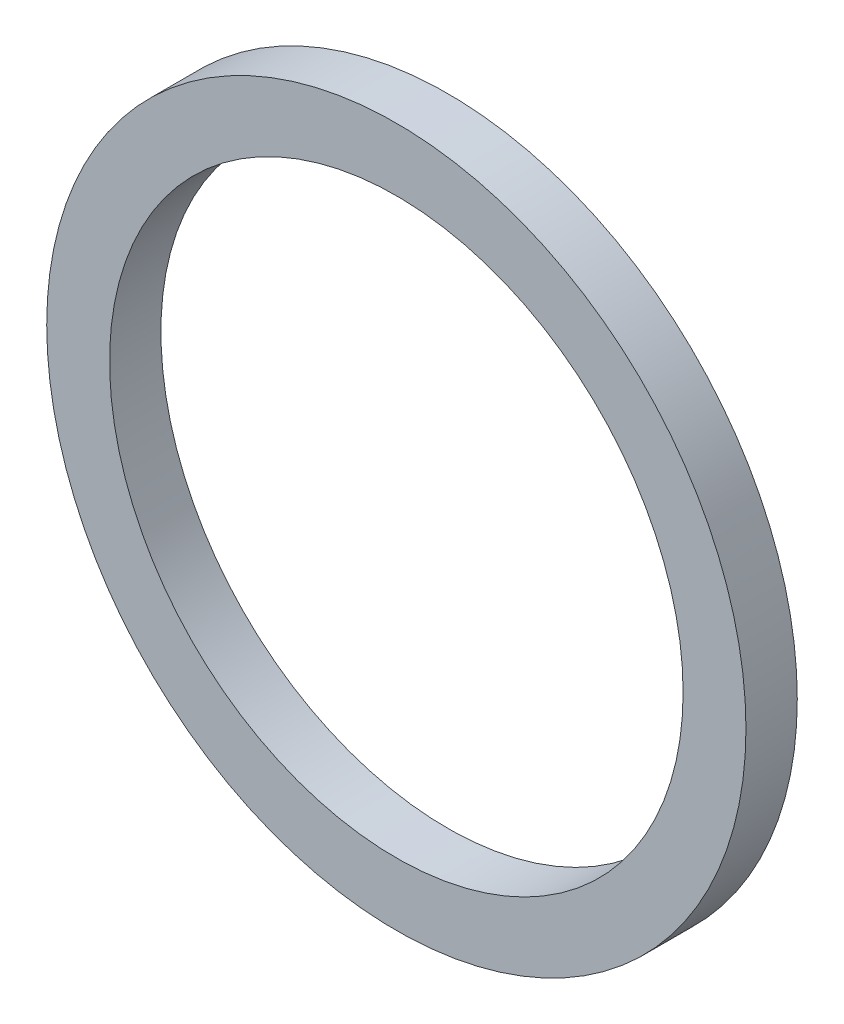
ISO-10303-21;
HEADER;
FILE_DESCRIPTION(('STEP AP214'),'2;1');
FILE_NAME('part.step','',(''),(''),'','','');
FILE_SCHEMA(('AUTOMOTIVE_DESIGN { 1 0 10303 214 1 1 1 1 }'));
ENDSEC;
DATA;
#1=APPLICATION_CONTEXT('core data for automotive mechanical design processes');
#2=APPLICATION_PROTOCOL_DEFINITION('international standard','automotive_design',2000,#1);
#3=PRODUCT_CONTEXT('',#1,'mechanical');
#4=PRODUCT('Part','Part','',(#3));
#5=PRODUCT_RELATED_PRODUCT_CATEGORY('part','',(#4));
#6=PRODUCT_DEFINITION_FORMATION('','',#4);
#7=PRODUCT_DEFINITION_CONTEXT('part definition',#1,'design');
#8=PRODUCT_DEFINITION('design','',#6,#7);
#9=PRODUCT_DEFINITION_SHAPE('','',#8);
#10=(LENGTH_UNIT() NAMED_UNIT(*) SI_UNIT(.MILLI.,.METRE.));
#11=(NAMED_UNIT(*) PLANE_ANGLE_UNIT() SI_UNIT($,.RADIAN.));
#12=(NAMED_UNIT(*) SI_UNIT($,.STERADIAN.) SOLID_ANGLE_UNIT());
#13=UNCERTAINTY_MEASURE_WITH_UNIT(LENGTH_MEASURE(1.E-05),#10,'distance_accuracy_value','');
#14=(GEOMETRIC_REPRESENTATION_CONTEXT(3) GLOBAL_UNCERTAINTY_ASSIGNED_CONTEXT((#13)) GLOBAL_UNIT_ASSIGNED_CONTEXT((#10,
#11,#12)) REPRESENTATION_CONTEXT('',''));
#15=CARTESIAN_POINT('',(0.,0.,0.));
#16=DIRECTION('',(0.,0.,1.));
#17=DIRECTION('',(1.,0.,0.));
#18=AXIS2_PLACEMENT_3D('',#15,#16,#17);
#19=CARTESIAN_POINT('',(0.,0.,19.6));
#20=DIRECTION('',(0.,0.,1.));
#21=DIRECTION('',(1.,0.,0.));
#22=AXIS2_PLACEMENT_3D('',#19,#20,#21);
#23=PLANE('',#22);
#24=CARTESIAN_POINT('',(0.,0.,19.6));
#25=DIRECTION('',(0.,0.,1.));
#26=DIRECTION('',(1.,0.,0.));
#27=AXIS2_PLACEMENT_3D('',#24,#25,#26);
#28=CIRCLE('',#27,133.5);
#29=CARTESIAN_POINT('',(133.5,0.,19.6));
#30=VERTEX_POINT('',#29);
#31=EDGE_CURVE('E10',#30,#30,#28,.T.);
#32=ORIENTED_EDGE('',*,*,#31,.T.);
#33=EDGE_LOOP('',(#32));
#34=FACE_BOUND('',#33,.T.);
#35=CARTESIAN_POINT('',(0.,0.,19.6));
#36=DIRECTION('',(0.,0.,1.));
#37=DIRECTION('',(1.,0.,0.));
#38=AXIS2_PLACEMENT_3D('',#35,#36,#37);
#39=CIRCLE('',#38,109.5);
#40=CARTESIAN_POINT('',(109.5,0.,19.6));
#41=VERTEX_POINT('',#40);
#42=EDGE_CURVE('E44',#41,#41,#39,.T.);
#43=ORIENTED_EDGE('',*,*,#42,.F.);
#44=EDGE_LOOP('',(#43));
#45=FACE_BOUND('',#44,.T.);
#46=ADVANCED_FACE('F33',(#34,#45),#23,.T.);
#47=CARTESIAN_POINT('',(0.,0.,0.));
#48=DIRECTION('',(0.,0.,1.));
#49=DIRECTION('',(1.,0.,0.));
#50=AXIS2_PLACEMENT_3D('',#47,#48,#49);
#51=PLANE('',#50);
#52=CARTESIAN_POINT('',(0.,0.,0.));
#53=DIRECTION('',(0.,0.,1.));
#54=DIRECTION('',(1.,0.,0.));
#55=AXIS2_PLACEMENT_3D('',#52,#53,#54);
#56=CIRCLE('',#55,133.5);
#57=CARTESIAN_POINT('',(133.5,0.,0.));
#58=VERTEX_POINT('',#57);
#59=EDGE_CURVE('E37',#58,#58,#56,.T.);
#60=ORIENTED_EDGE('',*,*,#59,.F.);
#61=EDGE_LOOP('',(#60));
#62=FACE_BOUND('',#61,.T.);
#63=CARTESIAN_POINT('',(0.,0.,0.));
#64=DIRECTION('',(0.,0.,1.));
#65=DIRECTION('',(1.,0.,0.));
#66=AXIS2_PLACEMENT_3D('',#63,#64,#65);
#67=CIRCLE('',#66,109.5);
#68=CARTESIAN_POINT('',(109.5,0.,0.));
#69=VERTEX_POINT('',#68);
#70=EDGE_CURVE('E46',#69,#69,#67,.T.);
#71=ORIENTED_EDGE('',*,*,#70,.T.);
#72=EDGE_LOOP('',(#71));
#73=FACE_BOUND('',#72,.T.);
#74=ADVANCED_FACE('F56',(#62,#73),#51,.F.);
#75=CARTESIAN_POINT('',(0.,0.,19.6));
#76=DIRECTION('',(0.,0.,-1.));
#77=DIRECTION('',(-1.,0.,0.));
#78=AXIS2_PLACEMENT_3D('',#75,#76,#77);
#79=CYLINDRICAL_SURFACE('',#78,133.5);
#80=ORIENTED_EDGE('',*,*,#31,.F.);
#81=EDGE_LOOP('',(#80));
#82=FACE_BOUND('',#81,.T.);
#83=ORIENTED_EDGE('',*,*,#59,.T.);
#84=EDGE_LOOP('',(#83));
#85=FACE_BOUND('',#84,.T.);
#86=ADVANCED_FACE('F35',(#82,#85),#79,.T.);
#87=CARTESIAN_POINT('',(0.,0.,19.6));
#88=DIRECTION('',(0.,0.,-1.));
#89=DIRECTION('',(-1.,0.,0.));
#90=AXIS2_PLACEMENT_3D('',#87,#88,#89);
#91=CYLINDRICAL_SURFACE('',#90,109.5);
#92=ORIENTED_EDGE('',*,*,#42,.T.);
#93=EDGE_LOOP('',(#92));
#94=FACE_BOUND('',#93,.T.);
#95=ORIENTED_EDGE('',*,*,#70,.F.);
#96=EDGE_LOOP('',(#95));
#97=FACE_BOUND('',#96,.T.);
#98=ADVANCED_FACE('F52',(#94,#97),#91,.F.);
#99=CLOSED_SHELL('',(#46,#74,#86,#98));
#100=MANIFOLD_SOLID_BREP('B2',#99);
#101=ADVANCED_BREP_SHAPE_REPRESENTATION('',(#18,#100),#14);
#102=SHAPE_DEFINITION_REPRESENTATION(#9,#101);
ENDSEC;
END-ISO-10303-21;
